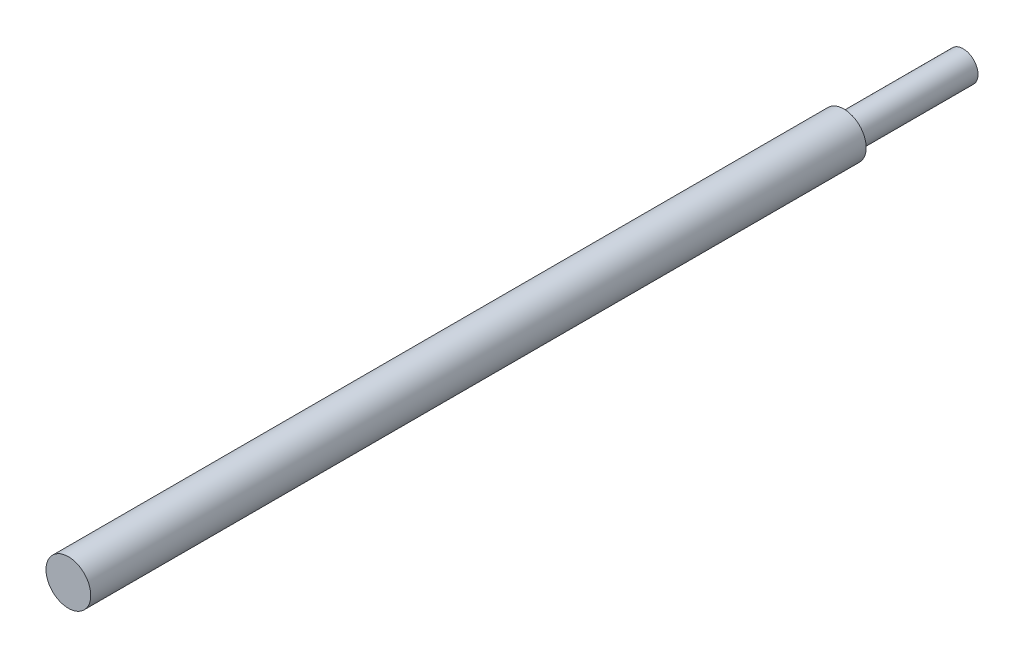
ISO-10303-21;
HEADER;
FILE_DESCRIPTION(('STEP AP214'),'2;1');
FILE_NAME('part.step','',(''),(''),'','','');
FILE_SCHEMA(('AUTOMOTIVE_DESIGN { 1 0 10303 214 1 1 1 1 }'));
ENDSEC;
DATA;
#1=APPLICATION_CONTEXT('core data for automotive mechanical design processes');
#2=APPLICATION_PROTOCOL_DEFINITION('international standard','automotive_design',2000,#1);
#3=PRODUCT_CONTEXT('',#1,'mechanical');
#4=PRODUCT('Part','Part','',(#3));
#5=PRODUCT_RELATED_PRODUCT_CATEGORY('part','',(#4));
#6=PRODUCT_DEFINITION_FORMATION('','',#4);
#7=PRODUCT_DEFINITION_CONTEXT('part definition',#1,'design');
#8=PRODUCT_DEFINITION('design','',#6,#7);
#9=PRODUCT_DEFINITION_SHAPE('','',#8);
#10=(LENGTH_UNIT() NAMED_UNIT(*) SI_UNIT(.MILLI.,.METRE.));
#11=(NAMED_UNIT(*) PLANE_ANGLE_UNIT() SI_UNIT($,.RADIAN.));
#12=(NAMED_UNIT(*) SI_UNIT($,.STERADIAN.) SOLID_ANGLE_UNIT());
#13=UNCERTAINTY_MEASURE_WITH_UNIT(LENGTH_MEASURE(1.E-05),#10,'distance_accuracy_value','');
#14=(GEOMETRIC_REPRESENTATION_CONTEXT(3) GLOBAL_UNCERTAINTY_ASSIGNED_CONTEXT((#13)) GLOBAL_UNIT_ASSIGNED_CONTEXT((#10,
#11,#12)) REPRESENTATION_CONTEXT('',''));
#15=CARTESIAN_POINT('',(0.,0.,0.));
#16=DIRECTION('',(0.,0.,1.));
#17=DIRECTION('',(1.,0.,0.));
#18=AXIS2_PLACEMENT_3D('',#15,#16,#17);
#19=CARTESIAN_POINT('',(0.,0.,300.));
#20=DIRECTION('',(0.,0.,-1.));
#21=DIRECTION('',(-1.,0.,0.));
#22=AXIS2_PLACEMENT_3D('',#19,#20,#21);
#23=CYLINDRICAL_SURFACE('',#22,7.5);
#24=CARTESIAN_POINT('',(0.,0.,300.));
#25=DIRECTION('',(0.,0.,1.));
#26=DIRECTION('',(1.,0.,0.));
#27=AXIS2_PLACEMENT_3D('',#24,#25,#26);
#28=CIRCLE('',#27,7.5);
#29=CARTESIAN_POINT('',(7.5,0.,300.));
#30=VERTEX_POINT('',#29);
#31=EDGE_CURVE('E11',#30,#30,#28,.T.);
#32=ORIENTED_EDGE('',*,*,#31,.F.);
#33=EDGE_LOOP('',(#32));
#34=FACE_BOUND('',#33,.T.);
#35=CARTESIAN_POINT('',(0.,0.,40.));
#36=DIRECTION('',(0.,0.,-1.));
#37=DIRECTION('',(-1.,0.,0.));
#38=AXIS2_PLACEMENT_3D('',#35,#36,#37);
#39=CIRCLE('',#38,7.5);
#40=CARTESIAN_POINT('',(-7.5,0.,40.));
#41=VERTEX_POINT('',#40);
#42=EDGE_CURVE('E40',#41,#41,#39,.T.);
#43=ORIENTED_EDGE('',*,*,#42,.F.);
#44=EDGE_LOOP('',(#43));
#45=FACE_BOUND('',#44,.T.);
#46=ADVANCED_FACE('F37',(#34,#45),#23,.T.);
#47=CARTESIAN_POINT('',(0.,0.,300.));
#48=DIRECTION('',(0.,0.,1.));
#49=DIRECTION('',(1.,0.,0.));
#50=AXIS2_PLACEMENT_3D('',#47,#48,#49);
#51=PLANE('',#50);
#52=ORIENTED_EDGE('',*,*,#31,.T.);
#53=EDGE_LOOP('',(#52));
#54=FACE_BOUND('',#53,.T.);
#55=ADVANCED_FACE('F65',(#54),#51,.T.);
#56=CARTESIAN_POINT('',(0.,0.,40.));
#57=DIRECTION('',(0.,0.,-1.));
#58=DIRECTION('',(-1.,0.,0.));
#59=AXIS2_PLACEMENT_3D('',#56,#57,#58);
#60=PLANE('',#59);
#61=CARTESIAN_POINT('',(0.,0.,40.));
#62=DIRECTION('',(0.,0.,-1.));
#63=DIRECTION('',(-1.,0.,0.));
#64=AXIS2_PLACEMENT_3D('',#61,#62,#63);
#65=CIRCLE('',#64,5.);
#66=CARTESIAN_POINT('',(-5.,0.,40.));
#67=VERTEX_POINT('',#66);
#68=EDGE_CURVE('E49',#67,#67,#65,.T.);
#69=ORIENTED_EDGE('',*,*,#68,.F.);
#70=EDGE_LOOP('',(#69));
#71=FACE_BOUND('',#70,.T.);
#72=ORIENTED_EDGE('',*,*,#42,.T.);
#73=EDGE_LOOP('',(#72));
#74=FACE_BOUND('',#73,.T.);
#75=ADVANCED_FACE('F62',(#71,#74),#60,.T.);
#76=CARTESIAN_POINT('',(0.,0.,40.));
#77=DIRECTION('',(0.,0.,-1.));
#78=DIRECTION('',(-1.,0.,0.));
#79=AXIS2_PLACEMENT_3D('',#76,#77,#78);
#80=CYLINDRICAL_SURFACE('',#79,5.);
#81=ORIENTED_EDGE('',*,*,#68,.T.);
#82=EDGE_LOOP('',(#81));
#83=FACE_BOUND('',#82,.T.);
#84=CARTESIAN_POINT('',(0.,0.,0.));
#85=DIRECTION('',(0.,0.,-1.));
#86=DIRECTION('',(-1.,0.,0.));
#87=AXIS2_PLACEMENT_3D('',#84,#85,#86);
#88=CIRCLE('',#87,5.);
#89=CARTESIAN_POINT('',(-5.,0.,0.));
#90=VERTEX_POINT('',#89);
#91=EDGE_CURVE('E51',#90,#90,#88,.T.);
#92=ORIENTED_EDGE('',*,*,#91,.F.);
#93=EDGE_LOOP('',(#92));
#94=FACE_BOUND('',#93,.T.);
#95=ADVANCED_FACE('F59',(#83,#94),#80,.T.);
#96=CARTESIAN_POINT('',(0.,0.,0.));
#97=DIRECTION('',(0.,0.,1.));
#98=DIRECTION('',(1.,0.,0.));
#99=AXIS2_PLACEMENT_3D('',#96,#97,#98);
#100=PLANE('',#99);
#101=ORIENTED_EDGE('',*,*,#91,.T.);
#102=EDGE_LOOP('',(#101));
#103=FACE_BOUND('',#102,.T.);
#104=ADVANCED_FACE('F80',(#103),#100,.F.);
#105=CLOSED_SHELL('',(#46,#55,#75,#95,#104));
#106=MANIFOLD_SOLID_BREP('B2',#105);
#107=ADVANCED_BREP_SHAPE_REPRESENTATION('',(#18,#106),#14);
#108=SHAPE_DEFINITION_REPRESENTATION(#9,#107);
ENDSEC;
END-ISO-10303-21;
